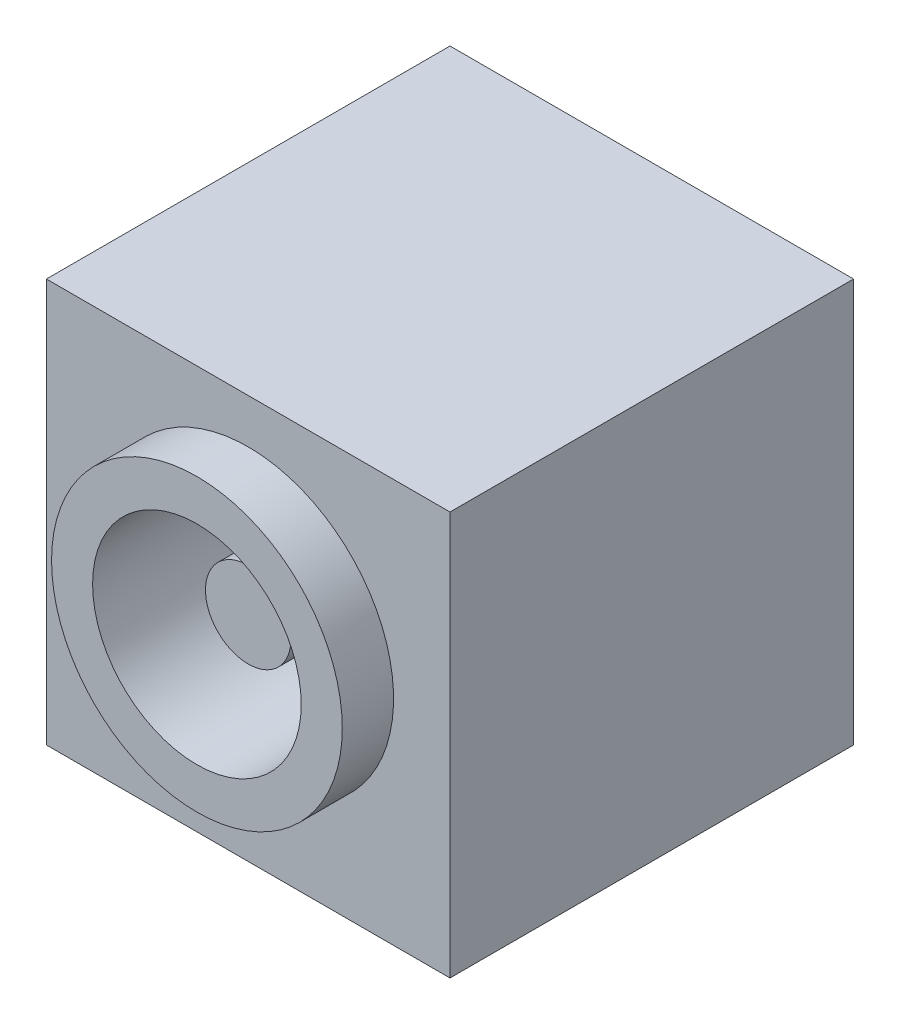
ISO-10303-21;
HEADER;
FILE_DESCRIPTION(('STEP AP214'),'2;1');
FILE_NAME('part.step','',(''),(''),'','','');
FILE_SCHEMA(('AUTOMOTIVE_DESIGN { 1 0 10303 214 1 1 1 1 }'));
ENDSEC;
DATA;
#1=APPLICATION_CONTEXT('core data for automotive mechanical design processes');
#2=APPLICATION_PROTOCOL_DEFINITION('international standard','automotive_design',2000,#1);
#3=PRODUCT_CONTEXT('',#1,'mechanical');
#4=PRODUCT('Part','Part','',(#3));
#5=PRODUCT_RELATED_PRODUCT_CATEGORY('part','',(#4));
#6=PRODUCT_DEFINITION_FORMATION('','',#4);
#7=PRODUCT_DEFINITION_CONTEXT('part definition',#1,'design');
#8=PRODUCT_DEFINITION('design','',#6,#7);
#9=PRODUCT_DEFINITION_SHAPE('','',#8);
#10=(LENGTH_UNIT() NAMED_UNIT(*) SI_UNIT(.MILLI.,.METRE.));
#11=(NAMED_UNIT(*) PLANE_ANGLE_UNIT() SI_UNIT($,.RADIAN.));
#12=(NAMED_UNIT(*) SI_UNIT($,.STERADIAN.) SOLID_ANGLE_UNIT());
#13=UNCERTAINTY_MEASURE_WITH_UNIT(LENGTH_MEASURE(1.E-05),#10,'distance_accuracy_value','');
#14=(GEOMETRIC_REPRESENTATION_CONTEXT(3) GLOBAL_UNCERTAINTY_ASSIGNED_CONTEXT((#13)) GLOBAL_UNIT_ASSIGNED_CONTEXT((#10,
#11,#12)) REPRESENTATION_CONTEXT('',''));
#15=CARTESIAN_POINT('',(0.,0.,0.));
#16=DIRECTION('',(0.,0.,1.));
#17=DIRECTION('',(1.,0.,0.));
#18=AXIS2_PLACEMENT_3D('',#15,#16,#17);
#19=CARTESIAN_POINT('',(5.9,6.25,-8.));
#20=DIRECTION('',(0.,0.,1.));
#21=DIRECTION('',(1.,0.,0.));
#22=AXIS2_PLACEMENT_3D('',#19,#20,#21);
#23=PLANE('',#22);
#24=CARTESIAN_POINT('',(5.9,6.25,-8.));
#25=DIRECTION('',(0.,0.,1.));
#26=DIRECTION('',(1.,0.,0.));
#27=AXIS2_PLACEMENT_3D('',#24,#25,#26);
#28=CIRCLE('',#27,3.05);
#29=CARTESIAN_POINT('',(8.95,6.25,-8.));
#30=VERTEX_POINT('',#29);
#31=EDGE_CURVE('E151',#30,#30,#28,.T.);
#32=ORIENTED_EDGE('',*,*,#31,.T.);
#33=EDGE_LOOP('',(#32));
#34=FACE_BOUND('',#33,.T.);
#35=CARTESIAN_POINT('',(5.9,6.25,-8.));
#36=DIRECTION('',(0.,0.,1.));
#37=DIRECTION('',(1.,0.,0.));
#38=AXIS2_PLACEMENT_3D('',#35,#36,#37);
#39=CIRCLE('',#38,1.25);
#40=CARTESIAN_POINT('',(7.15,6.25,-8.));
#41=VERTEX_POINT('',#40);
#42=EDGE_CURVE('E157',#41,#41,#39,.T.);
#43=ORIENTED_EDGE('',*,*,#42,.F.);
#44=EDGE_LOOP('',(#43));
#45=FACE_BOUND('',#44,.T.);
#46=ADVANCED_FACE('F32',(#34,#45),#23,.T.);
#47=CARTESIAN_POINT('',(0.,11.8,0.));
#48=DIRECTION('',(0.,0.,-1.));
#49=DIRECTION('',(-1.,0.,0.));
#50=AXIS2_PLACEMENT_3D('',#47,#48,#49);
#51=PLANE('',#50);
#52=DIRECTION('',(1.,0.,0.));
#53=VECTOR('',#52,1.);
#54=CARTESIAN_POINT('',(0.,0.,0.));
#55=LINE('',#54,#53);
#56=CARTESIAN_POINT('',(0.,0.,0.));
#57=VERTEX_POINT('',#56);
#58=CARTESIAN_POINT('',(11.8,0.,0.));
#59=VERTEX_POINT('',#58);
#60=EDGE_CURVE('E91',#57,#59,#55,.T.);
#61=ORIENTED_EDGE('',*,*,#60,.T.);
#62=DIRECTION('',(0.,-1.,0.));
#63=VECTOR('',#62,1.);
#64=CARTESIAN_POINT('',(11.8,11.8,0.));
#65=LINE('',#64,#63);
#66=CARTESIAN_POINT('',(11.8,11.8,0.));
#67=VERTEX_POINT('',#66);
#68=EDGE_CURVE('E88',#67,#59,#65,.T.);
#69=ORIENTED_EDGE('',*,*,#68,.F.);
#70=DIRECTION('',(1.,0.,0.));
#71=VECTOR('',#70,1.);
#72=CARTESIAN_POINT('',(0.,11.8,0.));
#73=LINE('',#72,#71);
#74=CARTESIAN_POINT('',(0.,11.8,0.));
#75=VERTEX_POINT('',#74);
#76=EDGE_CURVE('E80',#75,#67,#73,.T.);
#77=ORIENTED_EDGE('',*,*,#76,.F.);
#78=DIRECTION('',(0.,-1.,0.));
#79=VECTOR('',#78,1.);
#80=CARTESIAN_POINT('',(0.,11.8,0.));
#81=LINE('',#80,#79);
#82=EDGE_CURVE('E41',#75,#57,#81,.T.);
#83=ORIENTED_EDGE('',*,*,#82,.T.);
#84=EDGE_LOOP('',(#61,#69,#77,#83));
#85=FACE_BOUND('',#84,.T.);
#86=CARTESIAN_POINT('',(5.9,6.25,0.));
#87=DIRECTION('',(0.,0.,-1.));
#88=DIRECTION('',(-1.,0.,0.));
#89=AXIS2_PLACEMENT_3D('',#86,#87,#88);
#90=CIRCLE('',#89,4.25);
#91=CARTESIAN_POINT('',(1.65,6.25,0.));
#92=VERTEX_POINT('',#91);
#93=EDGE_CURVE('E11',#92,#92,#90,.F.);
#94=ORIENTED_EDGE('',*,*,#93,.F.);
#95=EDGE_LOOP('',(#94));
#96=FACE_BOUND('',#95,.T.);
#97=ADVANCED_FACE('F89',(#85,#96),#51,.F.);
#98=CARTESIAN_POINT('',(0.,11.8,0.));
#99=DIRECTION('',(1.,0.,0.));
#100=DIRECTION('',(0.,0.,-1.));
#101=AXIS2_PLACEMENT_3D('',#98,#99,#100);
#102=PLANE('',#101);
#103=DIRECTION('',(0.,0.,1.));
#104=VECTOR('',#103,1.);
#105=CARTESIAN_POINT('',(0.,0.,0.));
#106=LINE('',#105,#104);
#107=CARTESIAN_POINT('',(0.,0.,-11.8));
#108=VERTEX_POINT('',#107);
#109=EDGE_CURVE('E100',#108,#57,#106,.T.);
#110=ORIENTED_EDGE('',*,*,#109,.T.);
#111=ORIENTED_EDGE('',*,*,#82,.F.);
#112=DIRECTION('',(0.,0.,1.));
#113=VECTOR('',#112,1.);
#114=CARTESIAN_POINT('',(0.,11.8,0.));
#115=LINE('',#114,#113);
#116=CARTESIAN_POINT('',(0.,11.8,-11.8));
#117=VERTEX_POINT('',#116);
#118=EDGE_CURVE('E85',#117,#75,#115,.T.);
#119=ORIENTED_EDGE('',*,*,#118,.F.);
#120=DIRECTION('',(0.,-1.,0.));
#121=VECTOR('',#120,1.);
#122=CARTESIAN_POINT('',(0.,11.8,-11.8));
#123=LINE('',#122,#121);
#124=EDGE_CURVE('E96',#117,#108,#123,.T.);
#125=ORIENTED_EDGE('',*,*,#124,.T.);
#126=EDGE_LOOP('',(#110,#111,#119,#125));
#127=FACE_BOUND('',#126,.T.);
#128=ADVANCED_FACE('F34',(#127),#102,.F.);
#129=CARTESIAN_POINT('',(11.8,11.8,0.));
#130=DIRECTION('',(-1.,0.,0.));
#131=DIRECTION('',(0.,0.,1.));
#132=AXIS2_PLACEMENT_3D('',#129,#130,#131);
#133=PLANE('',#132);
#134=DIRECTION('',(0.,0.,-1.));
#135=VECTOR('',#134,1.);
#136=CARTESIAN_POINT('',(11.8,0.,0.));
#137=LINE('',#136,#135);
#138=CARTESIAN_POINT('',(11.8,0.,-11.8));
#139=VERTEX_POINT('',#138);
#140=EDGE_CURVE('E66',#59,#139,#137,.T.);
#141=ORIENTED_EDGE('',*,*,#140,.T.);
#142=DIRECTION('',(0.,-1.,0.));
#143=VECTOR('',#142,1.);
#144=CARTESIAN_POINT('',(11.8,11.8,-11.8));
#145=LINE('',#144,#143);
#146=CARTESIAN_POINT('',(11.8,11.8,-11.8));
#147=VERTEX_POINT('',#146);
#148=EDGE_CURVE('E92',#147,#139,#145,.T.);
#149=ORIENTED_EDGE('',*,*,#148,.F.);
#150=DIRECTION('',(0.,0.,-1.));
#151=VECTOR('',#150,1.);
#152=CARTESIAN_POINT('',(11.8,11.8,0.));
#153=LINE('',#152,#151);
#154=EDGE_CURVE('E83',#67,#147,#153,.T.);
#155=ORIENTED_EDGE('',*,*,#154,.F.);
#156=ORIENTED_EDGE('',*,*,#68,.T.);
#157=EDGE_LOOP('',(#141,#149,#155,#156));
#158=FACE_BOUND('',#157,.T.);
#159=ADVANCED_FACE('F94',(#158),#133,.F.);
#160=CARTESIAN_POINT('',(0.,11.8,-11.8));
#161=DIRECTION('',(0.,0.,1.));
#162=DIRECTION('',(1.,0.,0.));
#163=AXIS2_PLACEMENT_3D('',#160,#161,#162);
#164=PLANE('',#163);
#165=DIRECTION('',(-1.,0.,0.));
#166=VECTOR('',#165,1.);
#167=CARTESIAN_POINT('',(0.,0.,-11.8));
#168=LINE('',#167,#166);
#169=EDGE_CURVE('E72',#139,#108,#168,.T.);
#170=ORIENTED_EDGE('',*,*,#169,.T.);
#171=ORIENTED_EDGE('',*,*,#124,.F.);
#172=DIRECTION('',(-1.,0.,0.));
#173=VECTOR('',#172,1.);
#174=CARTESIAN_POINT('',(0.,11.8,-11.8));
#175=LINE('',#174,#173);
#176=EDGE_CURVE('E49',#147,#117,#175,.T.);
#177=ORIENTED_EDGE('',*,*,#176,.F.);
#178=ORIENTED_EDGE('',*,*,#148,.T.);
#179=EDGE_LOOP('',(#170,#171,#177,#178));
#180=FACE_BOUND('',#179,.T.);
#181=ADVANCED_FACE('F122',(#180),#164,.F.);
#182=CARTESIAN_POINT('',(0.,11.8,0.));
#183=DIRECTION('',(0.,-1.,0.));
#184=DIRECTION('',(0.,0.,-1.));
#185=AXIS2_PLACEMENT_3D('',#182,#183,#184);
#186=PLANE('',#185);
#187=ORIENTED_EDGE('',*,*,#118,.T.);
#188=ORIENTED_EDGE('',*,*,#76,.T.);
#189=ORIENTED_EDGE('',*,*,#154,.T.);
#190=ORIENTED_EDGE('',*,*,#176,.T.);
#191=EDGE_LOOP('',(#187,#188,#189,#190));
#192=FACE_BOUND('',#191,.T.);
#193=ADVANCED_FACE('F81',(#192),#186,.F.);
#194=CARTESIAN_POINT('',(0.,0.,0.));
#195=DIRECTION('',(0.,-1.,0.));
#196=DIRECTION('',(0.,0.,-1.));
#197=AXIS2_PLACEMENT_3D('',#194,#195,#196);
#198=PLANE('',#197);
#199=ORIENTED_EDGE('',*,*,#109,.F.);
#200=ORIENTED_EDGE('',*,*,#169,.F.);
#201=ORIENTED_EDGE('',*,*,#140,.F.);
#202=ORIENTED_EDGE('',*,*,#60,.F.);
#203=EDGE_LOOP('',(#199,#200,#201,#202));
#204=FACE_BOUND('',#203,.T.);
#205=ADVANCED_FACE('F111',(#204),#198,.T.);
#206=CARTESIAN_POINT('',(5.9,6.25,1.5));
#207=DIRECTION('',(0.,0.,-1.));
#208=DIRECTION('',(-1.,0.,0.));
#209=AXIS2_PLACEMENT_3D('',#206,#207,#208);
#210=CYLINDRICAL_SURFACE('',#209,4.25);
#211=CARTESIAN_POINT('',(5.9,6.25,1.5));
#212=DIRECTION('',(0.,0.,1.));
#213=DIRECTION('',(1.,0.,0.));
#214=AXIS2_PLACEMENT_3D('',#211,#212,#213);
#215=CIRCLE('',#214,4.25);
#216=CARTESIAN_POINT('',(10.15,6.25,1.5));
#217=VERTEX_POINT('',#216);
#218=EDGE_CURVE('E103',#217,#217,#215,.T.);
#219=ORIENTED_EDGE('',*,*,#218,.F.);
#220=EDGE_LOOP('',(#219));
#221=FACE_BOUND('',#220,.T.);
#222=ORIENTED_EDGE('',*,*,#93,.T.);
#223=EDGE_LOOP('',(#222));
#224=FACE_BOUND('',#223,.T.);
#225=ADVANCED_FACE('F113',(#221,#224),#210,.T.);
#226=CARTESIAN_POINT('',(5.9,6.25,1.5));
#227=DIRECTION('',(0.,0.,1.));
#228=DIRECTION('',(1.,0.,0.));
#229=AXIS2_PLACEMENT_3D('',#226,#227,#228);
#230=PLANE('',#229);
#231=CARTESIAN_POINT('',(5.9,6.25,1.5));
#232=DIRECTION('',(0.,0.,1.));
#233=DIRECTION('',(1.,0.,0.));
#234=AXIS2_PLACEMENT_3D('',#231,#232,#233);
#235=CIRCLE('',#234,3.05);
#236=CARTESIAN_POINT('',(8.95,6.25,1.5));
#237=VERTEX_POINT('',#236);
#238=EDGE_CURVE('E148',#237,#237,#235,.T.);
#239=ORIENTED_EDGE('',*,*,#238,.F.);
#240=EDGE_LOOP('',(#239));
#241=FACE_BOUND('',#240,.T.);
#242=ORIENTED_EDGE('',*,*,#218,.T.);
#243=EDGE_LOOP('',(#242));
#244=FACE_BOUND('',#243,.T.);
#245=ADVANCED_FACE('F119',(#241,#244),#230,.T.);
#246=CARTESIAN_POINT('',(5.9,6.25,-8.));
#247=DIRECTION('',(0.,0.,1.));
#248=DIRECTION('',(1.,0.,0.));
#249=AXIS2_PLACEMENT_3D('',#246,#247,#248);
#250=CYLINDRICAL_SURFACE('',#249,3.05);
#251=ORIENTED_EDGE('',*,*,#31,.F.);
#252=EDGE_LOOP('',(#251));
#253=FACE_BOUND('',#252,.T.);
#254=ORIENTED_EDGE('',*,*,#238,.T.);
#255=EDGE_LOOP('',(#254));
#256=FACE_BOUND('',#255,.T.);
#257=ADVANCED_FACE('F137',(#253,#256),#250,.F.);
#258=CARTESIAN_POINT('',(5.9,6.25,0.));
#259=DIRECTION('',(0.,0.,-1.));
#260=DIRECTION('',(-1.,0.,0.));
#261=AXIS2_PLACEMENT_3D('',#258,#259,#260);
#262=CYLINDRICAL_SURFACE('',#261,1.25);
#263=CARTESIAN_POINT('',(5.9,6.25,0.));
#264=DIRECTION('',(0.,0.,1.));
#265=DIRECTION('',(1.,0.,0.));
#266=AXIS2_PLACEMENT_3D('',#263,#264,#265);
#267=CIRCLE('',#266,1.25);
#268=CARTESIAN_POINT('',(7.15,6.25,0.));
#269=VERTEX_POINT('',#268);
#270=EDGE_CURVE('E155',#269,#269,#267,.T.);
#271=ORIENTED_EDGE('',*,*,#270,.F.);
#272=EDGE_LOOP('',(#271));
#273=FACE_BOUND('',#272,.T.);
#274=ORIENTED_EDGE('',*,*,#42,.T.);
#275=EDGE_LOOP('',(#274));
#276=FACE_BOUND('',#275,.T.);
#277=ADVANCED_FACE('F135',(#273,#276),#262,.T.);
#278=CARTESIAN_POINT('',(5.9,6.25,0.));
#279=DIRECTION('',(0.,0.,1.));
#280=DIRECTION('',(1.,0.,0.));
#281=AXIS2_PLACEMENT_3D('',#278,#279,#280);
#282=PLANE('',#281);
#283=ORIENTED_EDGE('',*,*,#270,.T.);
#284=EDGE_LOOP('',(#283));
#285=FACE_BOUND('',#284,.T.);
#286=ADVANCED_FACE('F163',(#285),#282,.T.);
#287=CLOSED_SHELL('',(#46,#97,#128,#159,#181,#193,#205,#225,#245,#257,#277,#286));
#288=MANIFOLD_SOLID_BREP('B2',#287);
#289=ADVANCED_BREP_SHAPE_REPRESENTATION('',(#18,#288),#14);
#290=SHAPE_DEFINITION_REPRESENTATION(#9,#289);
ENDSEC;
END-ISO-10303-21;
